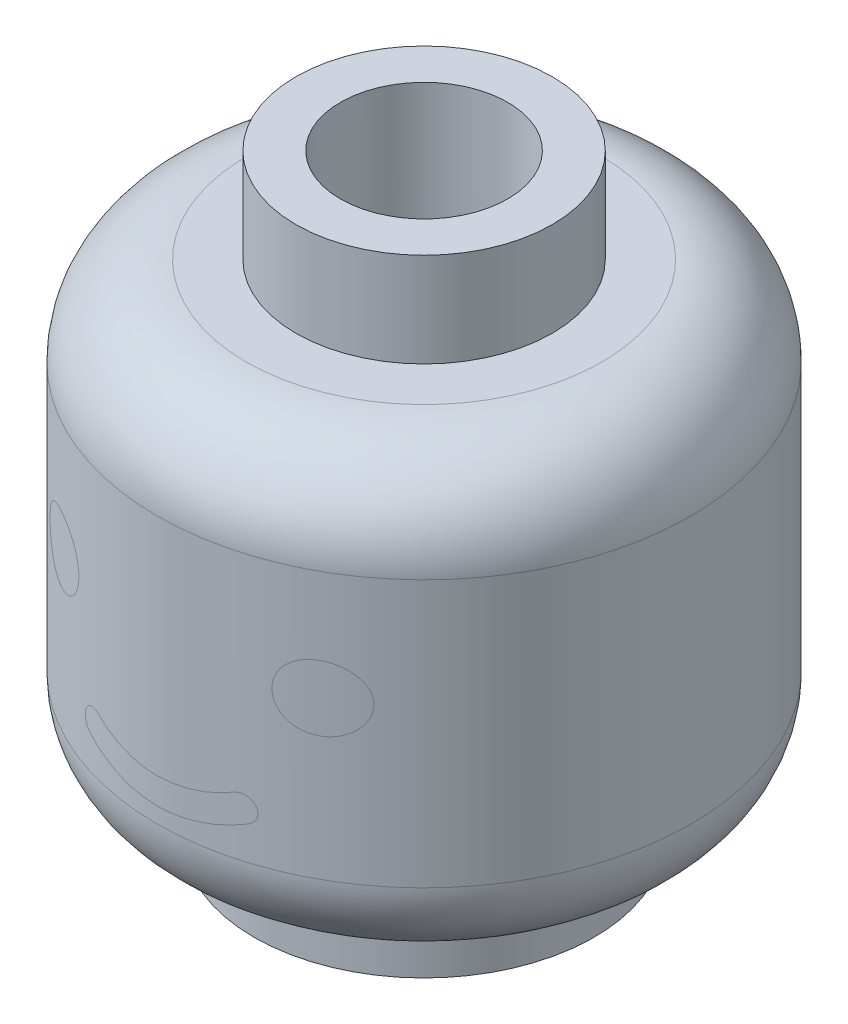
ISO-10303-21;
HEADER;
FILE_DESCRIPTION(('STEP AP214'),'2;1');
FILE_NAME('part.step','',(''),(''),'','','');
FILE_SCHEMA(('AUTOMOTIVE_DESIGN { 1 0 10303 214 1 1 1 1 }'));
ENDSEC;
DATA;
#1=APPLICATION_CONTEXT('core data for automotive mechanical design processes');
#2=APPLICATION_PROTOCOL_DEFINITION('international standard','automotive_design',2000,#1);
#3=PRODUCT_CONTEXT('',#1,'mechanical');
#4=PRODUCT('Part','Part','',(#3));
#5=PRODUCT_RELATED_PRODUCT_CATEGORY('part','',(#4));
#6=PRODUCT_DEFINITION_FORMATION('','',#4);
#7=PRODUCT_DEFINITION_CONTEXT('part definition',#1,'design');
#8=PRODUCT_DEFINITION('design','',#6,#7);
#9=PRODUCT_DEFINITION_SHAPE('','',#8);
#10=(LENGTH_UNIT() NAMED_UNIT(*) SI_UNIT(.MILLI.,.METRE.));
#11=(NAMED_UNIT(*) PLANE_ANGLE_UNIT() SI_UNIT($,.RADIAN.));
#12=(NAMED_UNIT(*) SI_UNIT($,.STERADIAN.) SOLID_ANGLE_UNIT());
#13=UNCERTAINTY_MEASURE_WITH_UNIT(LENGTH_MEASURE(1.E-05),#10,'distance_accuracy_value','');
#14=(GEOMETRIC_REPRESENTATION_CONTEXT(3) GLOBAL_UNCERTAINTY_ASSIGNED_CONTEXT((#13)) GLOBAL_UNIT_ASSIGNED_CONTEXT((#10,
#11,#12)) REPRESENTATION_CONTEXT('',''));
#15=CARTESIAN_POINT('',(0.,0.,0.));
#16=DIRECTION('',(0.,0.,1.));
#17=DIRECTION('',(1.,0.,0.));
#18=AXIS2_PLACEMENT_3D('',#15,#16,#17);
#19=CARTESIAN_POINT('',(0.,16.3137254901961,0.));
#20=DIRECTION('',(0.,1.,0.));
#21=DIRECTION('',(0.,0.,1.));
#22=AXIS2_PLACEMENT_3D('',#19,#20,#21);
#23=CYLINDRICAL_SURFACE('',#22,5.1);
#24=CARTESIAN_POINT('',(-1.50769230769231,3.44138259592501,4.87204925111861));
#25=CARTESIAN_POINT('',(-1.52043967292613,3.4474564505616,4.8681058314694));
#26=CARTESIAN_POINT('',(-1.53269286417562,3.45464139597266,4.8642577897413));
#27=CARTESIAN_POINT('',(-1.55589250859926,3.47104311079215,4.85688619617928));
#28=CARTESIAN_POINT('',(-1.56683698219197,3.48026289965649,4.85336313771352));
#29=CARTESIAN_POINT('',(-1.58707582301318,3.50053973792936,4.84678294474081));
#30=CARTESIAN_POINT('',(-1.59636769813775,3.511599514225,4.84372651487204));
#31=CARTESIAN_POINT('',(-1.61295657674623,3.5352493193438,4.83822771457206));
#32=CARTESIAN_POINT('',(-1.62025545628484,3.54783789283012,4.83578476683059));
#33=CARTESIAN_POINT('',(-1.63236860273475,3.57371605014675,4.83170905341994));
#34=CARTESIAN_POINT('',(-1.63726298223319,3.58696397945491,4.83005024650083));
#35=CARTESIAN_POINT('',(-1.6447606581698,3.6141668867311,4.82750228114942));
#36=CARTESIAN_POINT('',(-1.64736403867611,3.62812183873508,4.82661309447597));
#37=CARTESIAN_POINT('',(-1.65010793974114,3.65565450770353,4.8256756786411));
#38=CARTESIAN_POINT('',(-1.65035529915925,3.66922043101216,4.82559096925891));
#39=CARTESIAN_POINT('',(-1.64865652144264,3.69619560410523,4.82617161631263));
#40=CARTESIAN_POINT('',(-1.64671082263277,3.7096048846566,4.82683682286343));
#41=CARTESIAN_POINT('',(-1.64074370899042,3.73569327241718,4.82886836678685));
#42=CARTESIAN_POINT('',(-1.636752249198,3.74838005856888,4.83022458439052));
#43=CARTESIAN_POINT('',(-1.62685101576418,3.77289142356372,4.83356834226028));
#44=CARTESIAN_POINT('',(-1.62094102115567,3.78471590289853,4.83555595524672));
#45=CARTESIAN_POINT('',(-1.60722465311738,3.80749394622554,4.8401324647687));
#46=CARTESIAN_POINT('',(-1.59937464601847,3.81841842193289,4.84273512540892));
#47=CARTESIAN_POINT('',(-1.58210220160994,3.83880439642772,4.84840541985248));
#48=CARTESIAN_POINT('',(-1.57267943112406,3.84826558441048,4.85147315216454));
#49=CARTESIAN_POINT('',(-1.55204167920406,3.86593665965078,4.85811583063157));
#50=CARTESIAN_POINT('',(-1.54076259669134,3.87406520705755,4.86170800342955));
#51=CARTESIAN_POINT('',(-1.51708078753349,3.88831963859459,4.86914981269255));
#52=CARTESIAN_POINT('',(-1.50467785384334,3.89444515274784,4.87299949656403));
#53=CARTESIAN_POINT('',(-1.47850882396094,3.90478544564119,4.88100468466191));
#54=CARTESIAN_POINT('',(-1.46470682808762,3.90890489353763,4.88516619984672));
#55=CARTESIAN_POINT('',(-1.43659998874011,3.91472073516988,4.89350542540881));
#56=CARTESIAN_POINT('',(-1.42229491773682,3.91641601768843,4.89768314233359));
#57=CARTESIAN_POINT('',(-1.39329369908337,3.91733724973033,4.90601314199094));
#58=CARTESIAN_POINT('',(-1.37859536944953,3.91651433427535,4.91016333509879));
#59=CARTESIAN_POINT('',(-1.34952943734206,3.91228890667593,4.91823099172259));
#60=CARTESIAN_POINT('',(-1.33516133924489,3.90889056122908,4.92214882014501));
#61=CARTESIAN_POINT('',(-1.31133726767923,3.90097933375728,4.92853951469861));
#62=CARTESIAN_POINT('',(-1.30169035471946,3.89709772303175,4.93109580905959));
#63=CARTESIAN_POINT('',(-1.29230769230769,3.89261365365001,4.93355255656635));
#64=B_SPLINE_CURVE_WITH_KNOTS('',3,(#24,#25,#26,#27,#28,#29,#30,#31,#32,#33,#34,#35,#36,#37,#38,
#39,#40,#41,#42,#43,#44,#45,#46,#47,#48,#49,#50,#51,#52,#53,#54,#55,#56,#57,#58,#59,#60,#61,#62,
#63),.UNSPECIFIED.,.F.,.F.,(4,2,2,2,2,2,2,2,2,2,2,2,2,2,2,2,2,2,2,4),(0.,0.0439416944574802,
0.0879490366681005,0.132022189043521,0.176053710146527,0.21849726659161,0.260939265506972,
0.301446942698855,0.341946525088201,0.381869349720329,0.421796774093382,0.462720337939843,
0.503652582116524,0.54653968554057,0.589434706102917,0.634206586345368,0.678998983074021,
0.724666039085703,0.770259369283768,0.802304361634531),.UNSPECIFIED.);
#65=CARTESIAN_POINT('',(-1.50769230769231,3.44138259592501,4.87204925111861));
#66=VERTEX_POINT('',#65);
#67=CARTESIAN_POINT('',(-1.29230769230769,3.89261365365001,4.93355255656635));
#68=VERTEX_POINT('',#67);
#69=EDGE_CURVE('E11',#66,#68,#64,.T.);
#70=ORIENTED_EDGE('',*,*,#69,.F.);
#71=CARTESIAN_POINT('',(1.50769230769231,3.44138259592501,4.87204925111861));
#72=CARTESIAN_POINT('',(1.43370919433084,3.40606022573718,4.89495407410749));
#73=CARTESIAN_POINT('',(1.35811386347073,3.3731766335907,4.91649100065942));
#74=CARTESIAN_POINT('',(1.2040363960122,3.31257851100796,4.95647137250403));
#75=CARTESIAN_POINT('',(1.12555260718713,3.28486699584663,4.97491301264523));
#76=CARTESIAN_POINT('',(0.966045149993206,3.23492201701922,5.00833389598758));
#77=CARTESIAN_POINT('',(0.885019083900302,3.21269391141064,5.02330975175607));
#78=CARTESIAN_POINT('',(0.721007429883761,3.17403383232907,5.04945942252728));
#79=CARTESIAN_POINT('',(0.638022244406141,3.1576006793115,5.06063401124969));
#80=CARTESIAN_POINT('',(0.470341938526446,3.13070423759454,5.0789679987167));
#81=CARTESIAN_POINT('',(0.385641800372108,3.12026231266462,5.08611302716088));
#82=CARTESIAN_POINT('',(0.215422701344379,3.10559103943999,5.09616183980381));
#83=CARTESIAN_POINT('',(0.129903451362181,3.1013639726417,5.09906406645278));
#84=CARTESIAN_POINT('',(-0.0411401584996891,3.09919882840491,5.10054970587997));
#85=CARTESIAN_POINT('',(-0.126664351466689,3.1012521587025,5.09913901919221));
#86=CARTESIAN_POINT('',(-0.297167137913868,3.11159055971056,5.09205163156697));
#87=CARTESIAN_POINT('',(-0.382145530757173,3.11987780304852,5.08637344333132));
#88=CARTESIAN_POINT('',(-0.627524327727558,3.15289499515398,5.06381849287626));
#89=CARTESIAN_POINT('',(-0.786420138809057,3.18572107420379,5.04145572327317));
#90=CARTESIAN_POINT('',(-1.09567577625644,3.27204525157316,4.98339913410561));
#91=CARTESIAN_POINT('',(-1.24604317690775,3.32552466670639,4.94771736399732));
#92=CARTESIAN_POINT('',(-1.43015590623536,3.40523672245375,4.8955445408912));
#93=CARTESIAN_POINT('',(-1.46914933543684,3.42298135034975,4.88398074723492));
#94=CARTESIAN_POINT('',(-1.50769230769231,3.44138259592501,4.87204925111861));
#95=B_SPLINE_CURVE_WITH_KNOTS('',3,(#71,#72,#73,#74,#75,#76,#77,#78,#79,#80,#81,#82,#83,#84,#85,
#86,#87,#88,#89,#90,#91,#92,#93,#94),.UNSPECIFIED.,.F.,.F.,(4,2,2,2,2,2,2,2,2,2,2,4),(0.,
0.255337881999677,0.510824161884533,0.766559107420016,1.02224196881486,1.27883097745243,
1.53551415732444,1.79184632393748,2.04826786819921,2.53727993089787,3.02585066134497,
3.15893086233659),.UNSPECIFIED.);
#96=CARTESIAN_POINT('',(1.50769230769231,3.44138259592501,4.87204925111861));
#97=VERTEX_POINT('',#96);
#98=EDGE_CURVE('E57',#97,#66,#95,.T.);
#99=ORIENTED_EDGE('',*,*,#98,.F.);
#100=CARTESIAN_POINT('',(1.29230769230769,3.89261365365001,4.93355255656635));
#101=CARTESIAN_POINT('',(1.30547581043881,3.89891077888655,4.93010579071236));
#102=CARTESIAN_POINT('',(1.31915183921914,3.90401172049479,4.92646474923008));
#103=CARTESIAN_POINT('',(1.34708624675953,3.9117601564242,4.9188983466482));
#104=CARTESIAN_POINT('',(1.36134377179107,3.91441112127359,4.91497339625197));
#105=CARTESIAN_POINT('',(1.39004433472992,3.9172164010627,4.90693392801757));
#106=CARTESIAN_POINT('',(1.40448733222062,3.91737125099645,4.90281945099037));
#107=CARTESIAN_POINT('',(1.43316537111265,3.9152052568352,4.89451320311304));
#108=CARTESIAN_POINT('',(1.44740038106183,3.91288404215506,4.89032142078514));
#109=CARTESIAN_POINT('',(1.47549454384823,3.90577383065468,4.88191912657831));
#110=CARTESIAN_POINT('',(1.48934426446598,3.90094659642867,4.8777093569631));
#111=CARTESIAN_POINT('',(1.51603731604597,3.88892069454306,4.86947903536574));
#112=CARTESIAN_POINT('',(1.5288805409073,3.88172177728488,4.86545850335008));
#113=CARTESIAN_POINT('',(1.55310868426944,3.86516923307211,4.85777873628787));
#114=CARTESIAN_POINT('',(1.56450118210341,3.85582758520226,4.85411764845266));
#115=CARTESIAN_POINT('',(1.5855404736624,3.8351992503054,4.84728624825094));
#116=CARTESIAN_POINT('',(1.59518767499856,3.82391301863802,4.84411582131643));
#117=CARTESIAN_POINT('',(1.61207593416043,3.80014641023498,4.83852122803878));
#118=CARTESIAN_POINT('',(1.61939231837841,3.78772507738076,4.83607393971924));
#119=CARTESIAN_POINT('',(1.63181270066259,3.76171033048493,4.83189719824589));
#120=CARTESIAN_POINT('',(1.63691744863301,3.74811731560535,4.83016750178512));
#121=CARTESIAN_POINT('',(1.64450910384696,3.7208937992137,4.8275879214484));
#122=CARTESIAN_POINT('',(1.64711633024776,3.70730062387044,4.82669763698213));
#123=CARTESIAN_POINT('',(1.65005099029977,3.67984311327417,4.82569520940822));
#124=CARTESIAN_POINT('',(1.65037895663455,3.66597884213831,4.82558288448446));
#125=CARTESIAN_POINT('',(1.64877055251492,3.6388631223375,4.82613263793194));
#126=CARTESIAN_POINT('',(1.64690908206269,3.62560662147736,4.82676910067593));
#127=CARTESIAN_POINT('',(1.64111461427288,3.59961062361606,4.82874228779956));
#128=CARTESIAN_POINT('',(1.63718173609501,3.58687109692086,4.83007897189828));
#129=CARTESIAN_POINT('',(1.62735714430615,3.5621829071782,4.83339793329887));
#130=CARTESIAN_POINT('',(1.62145500029158,3.55023887047689,4.8353836470812));
#131=CARTESIAN_POINT('',(1.60788974919106,3.52750928414649,4.83991130908473));
#132=CARTESIAN_POINT('',(1.60022584652041,3.51672426115005,4.84245350858198));
#133=CARTESIAN_POINT('',(1.5830338897801,3.49616102461843,4.84810156183211));
#134=CARTESIAN_POINT('',(1.57344402263644,3.48643960952266,4.85122575286047));
#135=CARTESIAN_POINT('',(1.55289999584501,3.46874325292487,4.85784078726189));
#136=CARTESIAN_POINT('',(1.54194736011672,3.4607663876295,4.86133122041112));
#137=CARTESIAN_POINT('',(1.52307834801866,3.44922045026791,4.86726756952062));
#138=CARTESIAN_POINT('',(1.51547539128563,3.44509483345388,4.86964108354754));
#139=CARTESIAN_POINT('',(1.50769230769231,3.44138259592501,4.87204925111861));
#140=B_SPLINE_CURVE_WITH_KNOTS('',3,(#100,#101,#102,#103,#104,#105,#106,#107,#108,#109,#110,
#111,#112,#113,#114,#115,#116,#117,#118,#119,#120,#121,#122,#123,#124,#125,#126,#127,#128,#129,
#130,#131,#132,#133,#134,#135,#136,#137,#138,#139),.UNSPECIFIED.,.F.,.F.,(4,2,2,2,2,2,2,2,2,2,2,
2,2,2,2,2,2,2,2,4),(0.,0.0449214831244463,0.0897792344966953,0.134627371348439,0.17948222142776,
0.225042517255218,0.270607609431845,0.315923921130961,0.361229635578572,0.404872239555664,
0.448500033938545,0.489901006361839,0.531292302680101,0.571307829525006,0.611321054689822,
0.651549670089936,0.691796487962447,0.733637428926002,0.775431994718162,0.802293138858678),.UNSPECIFIED.);
#141=CARTESIAN_POINT('',(1.29230769230769,3.89261365365001,4.93355255656635));
#142=VERTEX_POINT('',#141);
#143=EDGE_CURVE('E367',#142,#97,#140,.T.);
#144=ORIENTED_EDGE('',*,*,#143,.F.);
#145=CARTESIAN_POINT('',(-1.29230769230769,3.89261365365001,4.93355255656635));
#146=CARTESIAN_POINT('',(-1.22588861700081,3.86090324758803,4.95095914365787));
#147=CARTESIAN_POINT('',(-1.15805426576759,3.83153246813223,4.96728590296533));
#148=CARTESIAN_POINT('',(-1.01989445783117,3.77771272134513,4.99747898840957));
#149=CARTESIAN_POINT('',(-0.94956784997922,3.75326606419884,5.01134415931557));
#150=CARTESIAN_POINT('',(-0.80694697347522,3.70960436625362,5.03627524479221));
#151=CARTESIAN_POINT('',(-0.734656246731728,3.69038051719443,5.04734587009734));
#152=CARTESIAN_POINT('',(-0.588491034726498,3.65733093315705,5.06647048512419));
#153=CARTESIAN_POINT('',(-0.514616830545435,3.64350424837156,5.07452500561787));
#154=CARTESIAN_POINT('',(-0.290786918112005,3.61032081744428,5.09390065599043));
#155=CARTESIAN_POINT('',(-0.139033730680465,3.59938691469713,5.10036060400772));
#156=CARTESIAN_POINT('',(0.164334920099962,3.6006664313833,5.09960801603805));
#157=CARTESIAN_POINT('',(0.315950389038476,3.61287886513585,5.09239606226549));
#158=CARTESIAN_POINT('',(0.537331849244905,3.64760150206827,5.07213847664396));
#159=CARTESIAN_POINT('',(0.609022976641742,3.66156465448469,5.064012679066));
#160=CARTESIAN_POINT('',(0.750868622750049,3.69457576168832,5.04492865198251));
#161=CARTESIAN_POINT('',(0.821022933784497,3.71362439916953,5.03397004219623));
#162=CARTESIAN_POINT('',(0.959438057657607,3.75663226680731,5.0094336969898));
#163=CARTESIAN_POINT('',(1.02769609882791,3.7805982955604,4.99585233700146));
#164=CARTESIAN_POINT('',(1.16184995911023,3.83317864627253,4.96637071044));
#165=CARTESIAN_POINT('',(1.22774673756994,3.8617910537253,4.95047139923637));
#166=CARTESIAN_POINT('',(1.29230769230769,3.89261365365001,4.93355255656635));
#167=B_SPLINE_CURVE_WITH_KNOTS('',3,(#145,#146,#147,#148,#149,#150,#151,#152,#153,#154,#155,
#156,#157,#158,#159,#160,#161,#162,#163,#164,#165,#166),.UNSPECIFIED.,.F.,.F.,(4,2,2,2,2,2,2,2,
2,2,4),(0.,0.226855024268325,0.453816232457578,0.680392260630389,0.90692839735625,
1.36128855000063,1.81562935426994,2.035892168566,2.2561845666244,2.4767836099487,
2.697291986622),.UNSPECIFIED.);
#168=EDGE_CURVE('E361',#68,#142,#167,.T.);
#169=ORIENTED_EDGE('',*,*,#168,.F.);
#170=EDGE_LOOP('',(#70,#99,#144,#169));
#171=FACE_BOUND('',#170,.T.);
#172=ADVANCED_FACE('F42',(#171),#23,.T.);
#173=CARTESIAN_POINT('',(3.095,5.8,4.0535139077102));
#174=CARTESIAN_POINT('',(3.09499860193585,5.76973944700259,4.05351520990944));
#175=CARTESIAN_POINT('',(3.09278766178486,5.73946755154224,4.05520602983803));
#176=CARTESIAN_POINT('',(3.08409267226761,5.67990287616726,4.0618223283753));
#177=CARTESIAN_POINT('',(3.07760525295517,5.65061088758105,4.06675035795551));
#178=CARTESIAN_POINT('',(3.06080334550029,5.59397829701904,4.07941069466848));
#179=CARTESIAN_POINT('',(3.05050880681332,5.56662839350486,4.08712837921838));
#180=CARTESIAN_POINT('',(3.02659584988562,5.51424445416662,4.10486765296008));
#181=CARTESIAN_POINT('',(3.01297657074637,5.48921102048146,4.11488983883357));
#182=CARTESIAN_POINT('',(2.98163294767719,5.43974161690707,4.13766486035557));
#183=CARTESIAN_POINT('',(2.96365703173191,5.41554014135022,4.15057798734039));
#184=CARTESIAN_POINT('',(2.92495832811053,5.37043965001354,4.17793983665437));
#185=CARTESIAN_POINT('',(2.9042342616573,5.34954218164892,4.19238927323921));
#186=CARTESIAN_POINT('',(2.85620082544248,5.30736765028644,4.22529532660076));
#187=CARTESIAN_POINT('',(2.8283988144999,5.28682871744111,4.24398018116912));
#188=CARTESIAN_POINT('',(2.77022658703615,5.25076242413528,4.28217918969877));
#189=CARTESIAN_POINT('',(2.739854509567,5.23523873500976,4.30169393940038));
#190=CARTESIAN_POINT('',(2.67243169046927,5.20740590893491,4.34395165708201));
#191=CARTESIAN_POINT('',(2.63506267930364,5.19592874977712,4.3667396050707));
#192=CARTESIAN_POINT('',(2.55862354696581,5.18008460849631,4.41196322532));
#193=CARTESIAN_POINT('',(2.51955276207472,5.17572042650937,4.43439875540534));
#194=CARTESIAN_POINT('',(2.4392707814489,5.17442051245818,4.47907820666036));
#195=CARTESIAN_POINT('',(2.3980335025884,5.17776162207383,4.50128527055906));
#196=CARTESIAN_POINT('',(2.31616559816084,5.19280193941225,4.54395252845122));
#197=CARTESIAN_POINT('',(2.27553473276848,5.20449774850702,4.564413428983));
#198=CARTESIAN_POINT('',(2.19940954765823,5.23522952074063,4.60154988307877));
#199=CARTESIAN_POINT('',(2.16375676573106,5.25366751074028,4.61839271449915));
#200=CARTESIAN_POINT('',(2.09592297204455,5.29768366935435,4.6495697657722));
#201=CARTESIAN_POINT('',(2.06373906836366,5.32325582554589,4.66390608154946));
#202=CARTESIAN_POINT('',(2.00782280643256,5.37766871267084,4.68822715267566));
#203=CARTESIAN_POINT('',(1.98354629633834,5.40581292125308,4.6985206527866));
#204=CARTESIAN_POINT('',(1.94010086196038,5.4665010857607,4.71662634450064));
#205=CARTESIAN_POINT('',(1.9209288069266,5.49904232627361,4.72444005761565));
#206=CARTESIAN_POINT('',(1.89009195435159,5.56437844594724,4.73685599133932));
#207=CARTESIAN_POINT('',(1.87790556056775,5.59688504466468,4.74168450559473));
#208=CARTESIAN_POINT('',(1.85905654473972,5.66370395844926,4.74910651657552));
#209=CARTESIAN_POINT('',(1.85239206114323,5.69801566082599,4.75170076653013));
#210=CARTESIAN_POINT('',(1.84506116193845,5.76567479081071,4.75455189833201));
#211=CARTESIAN_POINT('',(1.84411930354593,5.79898818188775,4.75491612322934));
#212=CARTESIAN_POINT('',(1.8475348885831,5.86529824031593,4.75359003329659));
#213=CARTESIAN_POINT('',(1.8518916575595,5.89829494743844,4.75189997995212));
#214=CARTESIAN_POINT('',(1.86564259871342,5.96262201623424,4.74651773484516));
#215=CARTESIAN_POINT('',(1.87497451161927,5.99396782192859,4.74285028209161));
#216=CARTESIAN_POINT('',(1.89827394433829,6.0545751910436,4.73357288763884));
#217=CARTESIAN_POINT('',(1.9122416015323,6.08383669266445,4.7279628883718));
#218=CARTESIAN_POINT('',(1.94459925360048,6.14007567413724,4.7147474575013));
#219=CARTESIAN_POINT('',(1.96306837257127,6.16699907019828,4.70710607285697));
#220=CARTESIAN_POINT('',(2.00360948770874,6.21731210056007,4.68999277485842));
#221=CARTESIAN_POINT('',(2.02568209851579,6.24070113069828,4.68052054917055));
#222=CARTESIAN_POINT('',(2.07388815582137,6.28459905511428,4.65936838278014));
#223=CARTESIAN_POINT('',(2.10017090727434,6.30490134929583,4.64760075102104));
#224=CARTESIAN_POINT('',(2.15503335901651,6.34083035809273,4.62241740714542));
#225=CARTESIAN_POINT('',(2.18361376667129,6.35645562577322,4.60900118681087));
#226=CARTESIAN_POINT('',(2.24467717791531,6.38400957409357,4.57959207992872));
#227=CARTESIAN_POINT('',(2.27728747840728,6.3955258483194,4.56347787002957));
#228=CARTESIAN_POINT('',(2.3433079341888,6.41297765223635,4.52993172346121));
#229=CARTESIAN_POINT('',(2.37671842702197,6.41891078271666,4.51249922376442));
#230=CARTESIAN_POINT('',(2.44701857025755,6.42567551206257,4.47480161963922));
#231=CARTESIAN_POINT('',(2.48390866670006,6.42591234520609,4.45443047845522));
#232=CARTESIAN_POINT('',(2.55678538677833,6.42002533739243,4.41300452057061));
#233=CARTESIAN_POINT('',(2.59277162760133,6.41389884637722,4.39194942256952));
#234=CARTESIAN_POINT('',(2.6662715936861,6.39470463785228,4.34775754752757));
#235=CARTESIAN_POINT('',(2.70362575043334,6.38105534439383,4.32460589287634));
#236=CARTESIAN_POINT('',(2.77542179929066,6.34674239519464,4.27888397771699));
#237=CARTESIAN_POINT('',(2.80986077083904,6.32607180672019,4.25631431564991));
#238=CARTESIAN_POINT('',(2.87521235954335,6.27760461201537,4.21244850739157));
#239=CARTESIAN_POINT('',(2.90607217390348,6.24971716700727,4.19117321133667));
#240=CARTESIAN_POINT('',(2.96238699485579,6.18721987408048,4.15155937417582));
#241=CARTESIAN_POINT('',(2.98785473518364,6.15262624224585,4.13321393978616));
#242=CARTESIAN_POINT('',(3.02464224828533,6.08959469501384,4.10632208099494));
#243=CARTESIAN_POINT('',(3.03787229533079,6.06279497201175,4.0965267546273));
#244=CARTESIAN_POINT('',(3.0605420992893,6.006860330539,4.0796179282492));
#245=CARTESIAN_POINT('',(3.06998826793891,5.97772946354869,4.07249989286133));
#246=CARTESIAN_POINT('',(3.08309706894776,5.9238696484317,4.06258118535075));
#247=CARTESIAN_POINT('',(3.08754141143147,5.89943598512386,4.05919967300131));
#248=CARTESIAN_POINT('',(3.09349349891351,5.85000414099652,4.05466546251341));
#249=CARTESIAN_POINT('',(3.09500115529656,5.82500594316506,4.05351283163204));
#250=CARTESIAN_POINT('',(3.095,5.8,4.0535139077102));
#251=B_SPLINE_CURVE_WITH_KNOTS('',3,(#173,#174,#175,#176,#177,#178,#179,#180,#181,#182,#183,
#184,#185,#186,#187,#188,#189,#190,#191,#192,#193,#194,#195,#196,#197,#198,#199,#200,#201,#202,
#203,#204,#205,#206,#207,#208,#209,#210,#211,#212,#213,#214,#215,#216,#217,#218,#219,#220,#221,
#222,#223,#224,#225,#226,#227,#228,#229,#230,#231,#232,#233,#234,#235,#236,#237,#238,#239,#240,
#241,#242,#243,#244,#245,#246,#247,#248,#249,#250),.UNSPECIFIED.,.T.,.F.,(4,2,2,2,2,2,2,2,2,2,2,
2,2,2,2,2,2,2,2,2,2,2,2,2,2,2,2,2,2,2,2,2,2,2,2,2,2,2,4),(0.,0.0906787627947074,
0.181429067721731,0.271710424098317,0.362015182506259,0.460048594000146,0.558127783807477,
0.675552291108697,0.793062563530542,0.928207018511045,1.0634046624073,1.20353508450097,
1.34360853504654,1.47345948899792,1.60320133803532,1.7182731462541,1.83327421325887,
1.9378900710966,2.04247064635766,2.14197490073356,2.241466490707,2.33974129513164,
2.43801901220197,2.53816759256269,2.63833327294725,2.74358604597446,2.84887134754808,
2.96286094284713,3.07689949987094,3.20279867331579,3.32875029952491,3.4661777460219,
3.60374128291714,3.74312854094349,3.88218286175426,3.97617380616964,4.0700048034043,
4.14493534315316,4.21986814391581),.UNSPECIFIED.);
#252=CARTESIAN_POINT('',(3.095,5.8,4.0535139077102));
#253=VERTEX_POINT('',#252);
#254=EDGE_CURVE('E249',#253,#253,#251,.T.);
#255=ORIENTED_EDGE('',*,*,#254,.F.);
#256=EDGE_LOOP('',(#255));
#257=FACE_BOUND('',#256,.T.);
#258=ADVANCED_FACE('F328',(#257),#23,.T.);
#259=CARTESIAN_POINT('',(-1.845,5.8,4.75457411341962));
#260=CARTESIAN_POINT('',(-1.84499920350535,5.76677691435292,4.75457430406465));
#261=CARTESIAN_POINT('',(-1.84765745197126,5.7335591049611,4.7535454255577));
#262=CARTESIAN_POINT('',(-1.85817944941604,5.66809411240501,4.74944215005716));
#263=CARTESIAN_POINT('',(-1.86604227741473,5.63584675856837,4.74636811496525));
#264=CARTESIAN_POINT('',(-1.88664902018034,5.57325933553667,4.7382145341163));
#265=CARTESIAN_POINT('',(-1.89938834187857,5.54291750278007,4.7331368753926));
#266=CARTESIAN_POINT('',(-1.92925604716883,5.48490358633524,4.72104115046017));
#267=CARTESIAN_POINT('',(-1.94638479583096,5.45723172497305,4.71402292284985));
#268=CARTESIAN_POINT('',(-1.98480643471912,5.40465898064081,4.69797663281727));
#269=CARTESIAN_POINT('',(-2.00617959699848,5.37982892466047,4.68890927025737));
#270=CARTESIAN_POINT('',(-2.05209341399138,5.33413635977726,4.66899755599778));
#271=CARTESIAN_POINT('',(-2.07663468338846,5.3132746227649,4.65815285934522));
#272=CARTESIAN_POINT('',(-2.12971385871981,5.27466832798192,4.63413613951042));
#273=CARTESIAN_POINT('',(-2.15840568668008,5.2572000639758,4.62086102409777));
#274=CARTESIAN_POINT('',(-2.21757981665435,5.22727869080855,4.59275666253795));
#275=CARTESIAN_POINT('',(-2.24806277153514,5.21482742350292,4.57792684813813));
#276=CARTESIAN_POINT('',(-2.31285861824305,5.19403514917957,4.54555965109184));
#277=CARTESIAN_POINT('',(-2.34726529958598,5.18617966834549,4.5278986997305));
#278=CARTESIAN_POINT('',(-2.4163055058728,5.17633387089331,4.49143570938817));
#279=CARTESIAN_POINT('',(-2.45093911465559,5.17434586059947,4.47263322466797));
#280=CARTESIAN_POINT('',(-2.52325916921179,5.17611685537798,4.43227373534371));
#281=CARTESIAN_POINT('',(-2.56088490612101,5.18050036852163,4.41063463996238));
#282=CARTESIAN_POINT('',(-2.63457975318231,5.19588293893036,4.36701578478511));
#283=CARTESIAN_POINT('',(-2.67064760647881,5.20688723461655,4.34503576867941));
#284=CARTESIAN_POINT('',(-2.74295186748084,5.23630198019467,4.29978635465344));
#285=CARTESIAN_POINT('',(-2.77900785672802,5.25519502552169,4.27654015828697));
#286=CARTESIAN_POINT('',(-2.84733166068423,5.30008583986028,4.23135638780459));
#287=CARTESIAN_POINT('',(-2.87960210218252,5.3260786401692,4.20941791152427));
#288=CARTESIAN_POINT('',(-2.93268717134774,5.37854822916121,4.17254799257693));
#289=CARTESIAN_POINT('',(-2.95446987197282,5.40370412439204,4.15712735978474));
#290=CARTESIAN_POINT('',(-2.99421695880275,5.45802025889412,4.12859077400189));
#291=CARTESIAN_POINT('',(-3.01218660388554,5.48717489056293,4.11547165120855));
#292=CARTESIAN_POINT('',(-3.0409034903585,5.54399980300233,4.09428532299961));
#293=CARTESIAN_POINT('',(-3.05235046496813,5.57113791146193,4.08574326423624));
#294=CARTESIAN_POINT('',(-3.07143318348613,5.6274193458188,4.07141762829973));
#295=CARTESIAN_POINT('',(-3.07907113905306,5.65656149688173,4.06563245046557));
#296=CARTESIAN_POINT('',(-3.09010947772414,5.71624909526878,4.05724946012816));
#297=CARTESIAN_POINT('',(-3.09348879207714,5.74680075044504,4.05466749583518));
#298=CARTESIAN_POINT('',(-3.09569963467274,5.8081628768688,4.05297992234742));
#299=CARTESIAN_POINT('',(-3.09453227476647,5.8389732830022,4.05387346324686));
#300=CARTESIAN_POINT('',(-3.08802567175795,5.89724716137949,4.05883124428674));
#301=CARTESIAN_POINT('',(-3.08304283395885,5.92477532018316,4.06262456648456));
#302=CARTESIAN_POINT('',(-3.06961591270729,5.97847171493769,4.07277894827268));
#303=CARTESIAN_POINT('',(-3.06117119267949,6.00463969978032,4.07914048010538));
#304=CARTESIAN_POINT('',(-3.04069350634257,6.05641611063272,4.09442957878904));
#305=CARTESIAN_POINT('',(-3.02849675209748,6.08192464060328,4.10347340152777));
#306=CARTESIAN_POINT('',(-3.00119582895742,6.13050501229469,4.12348274141375));
#307=CARTESIAN_POINT('',(-2.98609033819963,6.15357573875547,4.13444913206001));
#308=CARTESIAN_POINT('',(-2.95070954185588,6.20068570870961,4.15979090755149));
#309=CARTESIAN_POINT('',(-2.92999230215708,6.22425034360192,4.17443000782861));
#310=CARTESIAN_POINT('',(-2.88582877191806,6.26762265631486,4.20508222358603));
#311=CARTESIAN_POINT('',(-2.86238068216117,6.28742783436931,4.22109624308335));
#312=CARTESIAN_POINT('',(-2.80858923836408,6.32658207113989,4.25711881931157));
#313=CARTESIAN_POINT('',(-2.77778215172349,6.34512992997841,4.2773083445416));
#314=CARTESIAN_POINT('',(-2.71374426873498,6.37661808503823,4.31822174831926));
#315=CARTESIAN_POINT('',(-2.68051192130769,6.38955475524054,4.33894596325404));
#316=CARTESIAN_POINT('',(-2.60813242880629,6.41084755140794,4.38288088828667));
#317=CARTESIAN_POINT('',(-2.56875826416209,6.41845245861287,4.40608654373895));
#318=CARTESIAN_POINT('',(-2.48882428826254,6.42600499085684,4.45172688427581));
#319=CARTESIAN_POINT('',(-2.44826422911635,6.42595100332806,4.47416140600486));
#320=CARTESIAN_POINT('',(-2.36715265082265,6.41782512050633,4.51759928211651));
#321=CARTESIAN_POINT('',(-2.32660113155463,6.40975334717147,4.53860265826299));
#322=CARTESIAN_POINT('',(-2.24698327012814,6.38533644602389,4.57854194541311));
#323=CARTESIAN_POINT('',(-2.20791601521389,6.36899649429261,4.59747914089103));
#324=CARTESIAN_POINT('',(-2.13649451888951,6.32999794486318,4.63106954949723));
#325=CARTESIAN_POINT('',(-2.10385383669216,6.30806791178041,4.64595735309994));
#326=CARTESIAN_POINT('',(-2.04268538693218,6.25780992856741,4.67317417679004));
#327=CARTESIAN_POINT('',(-2.01415420983071,6.22948733283777,4.6855053218409));
#328=CARTESIAN_POINT('',(-1.96552275174193,6.1706997814256,4.70609624318402));
#329=CARTESIAN_POINT('',(-1.94483793675522,6.14082254564893,4.71465616030132));
#330=CARTESIAN_POINT('',(-1.90878827661837,6.0774751149707,4.72936655302359));
#331=CARTESIAN_POINT('',(-1.89342141667525,6.04400628711169,4.73551794125487));
#332=CARTESIAN_POINT('',(-1.86923845718362,5.97596079838044,4.74511446619856));
#333=CARTESIAN_POINT('',(-1.86018381238167,5.94148278662441,4.74865846920509));
#334=CARTESIAN_POINT('',(-1.84806584661198,5.8713342663301,4.75338786164922));
#335=CARTESIAN_POINT('',(-1.84500085501568,5.83566409313245,4.75457390876729));
#336=CARTESIAN_POINT('',(-1.845,5.8,4.75457411341962));
#337=B_SPLINE_CURVE_WITH_KNOTS('',3,(#259,#260,#261,#262,#263,#264,#265,#266,#267,#268,#269,
#270,#271,#272,#273,#274,#275,#276,#277,#278,#279,#280,#281,#282,#283,#284,#285,#286,#287,#288,
#289,#290,#291,#292,#293,#294,#295,#296,#297,#298,#299,#300,#301,#302,#303,#304,#305,#306,#307,
#308,#309,#310,#311,#312,#313,#314,#315,#316,#317,#318,#319,#320,#321,#322,#323,#324,#325,#326,
#327,#328,#329,#330,#331,#332,#333,#334,#335,#336),.UNSPECIFIED.,.T.,.F.,(4,2,2,2,2,2,2,2,2,2,2,
2,2,2,2,2,2,2,2,2,2,2,2,2,2,2,2,2,2,2,2,2,2,2,2,2,2,2,4),(0.,0.0995396134183573,
0.199061617438708,0.298490113473083,0.397926881693869,0.499462764286355,0.601018376800005,
0.708920840821429,0.816862882318314,0.934769207151073,1.05272187120697,1.18304336994216,
1.3134681160352,1.45342709615701,1.59328837704528,1.70289628355717,1.81235202446057,
1.9039731398253,1.9955409944317,2.08756010614522,2.17955671676834,2.26387342363708,
2.34820564172932,2.43692418242666,2.52568313644157,2.62917137321433,2.73272818294955,
2.85595521069489,2.97926175104852,3.11760918654601,3.25598575091373,3.39436021047522,
3.53264815122218,3.65808113191996,3.78340943749031,3.89481210487365,4.00617251923513,
4.11305544572557,4.21990855627139),.UNSPECIFIED.);
#338=CARTESIAN_POINT('',(-1.845,5.8,4.75457411341962));
#339=VERTEX_POINT('',#338);
#340=EDGE_CURVE('E241',#339,#339,#337,.T.);
#341=ORIENTED_EDGE('',*,*,#340,.F.);
#342=EDGE_LOOP('',(#341));
#343=FACE_BOUND('',#342,.T.);
#344=ADVANCED_FACE('F266',(#343),#23,.T.);
#345=CARTESIAN_POINT('',(0.,9.4,0.));
#346=DIRECTION('',(0.,-1.,0.));
#347=DIRECTION('',(0.,0.,-1.));
#348=AXIS2_PLACEMENT_3D('',#345,#346,#347);
#349=PLANE('',#348);
#350=DIRECTION('',(0.866025403784436,0.,0.500000000000004));
#351=VECTOR('',#350,1.);
#352=CARTESIAN_POINT('',(1.54704898937922,9.4,0.408214924348354));
#353=LINE('',#352,#351);
#354=CARTESIAN_POINT('',(0.420000000000002,9.4,-0.242487113059641));
#355=VERTEX_POINT('',#354);
#356=CARTESIAN_POINT('',(1.54704898937922,9.4,0.408214924348354));
#357=VERTEX_POINT('',#356);
#358=EDGE_CURVE('E130',#355,#357,#353,.T.);
#359=ORIENTED_EDGE('',*,*,#358,.F.);
#360=DIRECTION('',(0.,0.,1.));
#361=VECTOR('',#360,1.);
#362=CARTESIAN_POINT('',(0.420000000000002,9.4,-0.242487113059641));
#363=LINE('',#362,#361);
#364=CARTESIAN_POINT('',(0.42000000000001,9.4,-1.54389118787562));
#365=VERTEX_POINT('',#364);
#366=EDGE_CURVE('E139',#365,#355,#363,.T.);
#367=ORIENTED_EDGE('',*,*,#366,.F.);
#368=CARTESIAN_POINT('',(0.,9.4,0.));
#369=DIRECTION('',(0.,1.,0.));
#370=DIRECTION('',(0.,0.,1.));
#371=AXIS2_PLACEMENT_3D('',#368,#369,#370);
#372=CIRCLE('',#371,1.6);
#373=CARTESIAN_POINT('',(-0.42,9.4,-1.54389118787562));
#374=VERTEX_POINT('',#373);
#375=EDGE_CURVE('E222',#365,#374,#372,.T.);
#376=ORIENTED_EDGE('',*,*,#375,.T.);
#377=DIRECTION('',(0.,0.,-1.));
#378=VECTOR('',#377,1.);
#379=CARTESIAN_POINT('',(-0.42,9.4,-1.54389118787562));
#380=LINE('',#379,#378);
#381=CARTESIAN_POINT('',(-0.42,9.4,-0.242487113059643));
#382=VERTEX_POINT('',#381);
#383=EDGE_CURVE('E178',#382,#374,#380,.T.);
#384=ORIENTED_EDGE('',*,*,#383,.F.);
#385=DIRECTION('',(0.86602540378444,0.,-0.499999999999998));
#386=VECTOR('',#385,1.);
#387=CARTESIAN_POINT('',(-0.42,9.4,-0.242487113059643));
#388=LINE('',#387,#386);
#389=CARTESIAN_POINT('',(-1.54704898937922,9.4,0.408214924348344));
#390=VERTEX_POINT('',#389);
#391=EDGE_CURVE('E176',#390,#382,#388,.T.);
#392=ORIENTED_EDGE('',*,*,#391,.F.);
#393=CARTESIAN_POINT('',(-1.12704898937923,9.4,1.13567626352727));
#394=VERTEX_POINT('',#393);
#395=EDGE_CURVE('E223',#390,#394,#372,.T.);
#396=ORIENTED_EDGE('',*,*,#395,.T.);
#397=DIRECTION('',(-0.866025403784443,0.,0.499999999999992));
#398=VECTOR('',#397,1.);
#399=CARTESIAN_POINT('',(-1.12704898937923,9.4,1.13567626352727));
#400=LINE('',#399,#398);
#401=CARTESIAN_POINT('',(0.,9.4,0.484974226119286));
#402=VERTEX_POINT('',#401);
#403=EDGE_CURVE('E160',#402,#394,#400,.T.);
#404=ORIENTED_EDGE('',*,*,#403,.F.);
#405=DIRECTION('',(-0.866025403784433,0.,-0.50000000000001));
#406=VECTOR('',#405,1.);
#407=CARTESIAN_POINT('',(0.,9.4,0.484974226119286));
#408=LINE('',#407,#406);
#409=CARTESIAN_POINT('',(1.12704898937921,9.4,1.13567626352729));
#410=VERTEX_POINT('',#409);
#411=EDGE_CURVE('E157',#410,#402,#408,.T.);
#412=ORIENTED_EDGE('',*,*,#411,.F.);
#413=EDGE_CURVE('E151',#410,#357,#372,.T.);
#414=ORIENTED_EDGE('',*,*,#413,.T.);
#415=EDGE_LOOP('',(#359,#367,#376,#384,#392,#396,#404,#412,#414));
#416=FACE_BOUND('',#415,.T.);
#417=ADVANCED_FACE('F148',(#416),#349,.F.);
#418=CARTESIAN_POINT('',(0.,8.5,-2.45));
#419=DIRECTION('',(0.,1.,0.));
#420=DIRECTION('',(0.,0.,1.));
#421=AXIS2_PLACEMENT_3D('',#418,#419,#420);
#422=PLANE('',#421);
#423=CARTESIAN_POINT('',(0.,8.5,0.));
#424=DIRECTION('',(0.,1.,0.));
#425=DIRECTION('',(0.,0.,1.));
#426=AXIS2_PLACEMENT_3D('',#423,#424,#425);
#427=CIRCLE('',#426,1.6);
#428=CARTESIAN_POINT('',(1.54704898937922,8.5,0.408214924348354));
#429=VERTEX_POINT('',#428);
#430=CARTESIAN_POINT('',(0.42000000000001,8.5,-1.54389118787562));
#431=VERTEX_POINT('',#430);
#432=EDGE_CURVE('E238',#429,#431,#427,.T.);
#433=ORIENTED_EDGE('',*,*,#432,.T.);
#434=DIRECTION('',(0.,0.,1.));
#435=VECTOR('',#434,1.);
#436=CARTESIAN_POINT('',(0.420000000000017,8.5,-2.45));
#437=LINE('',#436,#435);
#438=CARTESIAN_POINT('',(0.420000000000002,8.5,-0.242487113059641));
#439=VERTEX_POINT('',#438);
#440=EDGE_CURVE('E174',#431,#439,#437,.T.);
#441=ORIENTED_EDGE('',*,*,#440,.T.);
#442=DIRECTION('',(0.866025403784436,0.,0.500000000000004));
#443=VECTOR('',#442,1.);
#444=CARTESIAN_POINT('',(-0.850881119635942,8.5,-0.976230669589473));
#445=LINE('',#444,#443);
#446=EDGE_CURVE('E133',#439,#429,#445,.T.);
#447=ORIENTED_EDGE('',*,*,#446,.T.);
#448=EDGE_LOOP('',(#433,#441,#447));
#449=FACE_BOUND('',#448,.T.);
#450=CARTESIAN_POINT('',(0.,8.5,0.));
#451=DIRECTION('',(0.,1.,0.));
#452=DIRECTION('',(0.,0.,1.));
#453=AXIS2_PLACEMENT_3D('',#450,#451,#452);
#454=CIRCLE('',#453,1.6);
#455=CARTESIAN_POINT('',(-1.12704898937923,8.5,1.13567626352727));
#456=VERTEX_POINT('',#455);
#457=CARTESIAN_POINT('',(1.12704898937921,8.5,1.13567626352729));
#458=VERTEX_POINT('',#457);
#459=EDGE_CURVE('E235',#456,#458,#454,.T.);
#460=ORIENTED_EDGE('',*,*,#459,.T.);
#461=DIRECTION('',(-0.866025403784433,0.,-0.50000000000001));
#462=VECTOR('',#461,1.);
#463=CARTESIAN_POINT('',(-1.27088111963596,8.5,-0.248769330410562));
#464=LINE('',#463,#462);
#465=CARTESIAN_POINT('',(0.,8.5,0.484974226119286));
#466=VERTEX_POINT('',#465);
#467=EDGE_CURVE('E170',#458,#466,#464,.T.);
#468=ORIENTED_EDGE('',*,*,#467,.T.);
#469=DIRECTION('',(-0.866025403784443,0.,0.499999999999992));
#470=VECTOR('',#469,1.);
#471=CARTESIAN_POINT('',(1.27088111963592,8.5,-0.248769330410514));
#472=LINE('',#471,#470);
#473=EDGE_CURVE('E155',#466,#456,#472,.T.);
#474=ORIENTED_EDGE('',*,*,#473,.T.);
#475=EDGE_LOOP('',(#460,#468,#474));
#476=FACE_BOUND('',#475,.T.);
#477=CARTESIAN_POINT('',(0.,8.5,0.));
#478=DIRECTION('',(0.,1.,0.));
#479=DIRECTION('',(0.,0.,1.));
#480=AXIS2_PLACEMENT_3D('',#477,#478,#479);
#481=CIRCLE('',#480,1.6);
#482=CARTESIAN_POINT('',(-0.42,8.5,-1.54389118787562));
#483=VERTEX_POINT('',#482);
#484=CARTESIAN_POINT('',(-1.54704898937922,8.5,0.408214924348344));
#485=VERTEX_POINT('',#484);
#486=EDGE_CURVE('E229',#483,#485,#481,.T.);
#487=ORIENTED_EDGE('',*,*,#486,.T.);
#488=DIRECTION('',(0.86602540378444,0.,-0.499999999999998));
#489=VECTOR('',#488,1.);
#490=CARTESIAN_POINT('',(0.850881119635936,8.5,-0.976230669589461));
#491=LINE('',#490,#489);
#492=CARTESIAN_POINT('',(-0.42,8.5,-0.242487113059643));
#493=VERTEX_POINT('',#492);
#494=EDGE_CURVE('E232',#485,#493,#491,.T.);
#495=ORIENTED_EDGE('',*,*,#494,.T.);
#496=DIRECTION('',(0.,0.,-1.));
#497=VECTOR('',#496,1.);
#498=CARTESIAN_POINT('',(-0.42,8.5,-2.45));
#499=LINE('',#498,#497);
#500=EDGE_CURVE('E226',#493,#483,#499,.T.);
#501=ORIENTED_EDGE('',*,*,#500,.T.);
#502=EDGE_LOOP('',(#487,#495,#501));
#503=FACE_BOUND('',#502,.T.);
#504=CARTESIAN_POINT('',(0.,8.5,0.));
#505=DIRECTION('',(0.,1.,0.));
#506=DIRECTION('',(0.,0.,1.));
#507=AXIS2_PLACEMENT_3D('',#504,#505,#506);
#508=CIRCLE('',#507,2.45);
#509=CARTESIAN_POINT('',(0.,8.5,2.45));
#510=VERTEX_POINT('',#509);
#511=EDGE_CURVE('E184',#510,#510,#508,.T.);
#512=ORIENTED_EDGE('',*,*,#511,.F.);
#513=EDGE_LOOP('',(#512));
#514=FACE_BOUND('',#513,.T.);
#515=ADVANCED_FACE('F259',(#449,#476,#503,#514),#422,.F.);
#516=CARTESIAN_POINT('',(0.,16.3137254901961,0.));
#517=DIRECTION('',(0.,1.,0.));
#518=DIRECTION('',(0.,0.,1.));
#519=AXIS2_PLACEMENT_3D('',#516,#517,#518);
#520=CYLINDRICAL_SURFACE('',#519,1.6);
#521=ORIENTED_EDGE('',*,*,#395,.F.);
#522=DIRECTION('',(0.,1.,0.));
#523=VECTOR('',#522,1.);
#524=CARTESIAN_POINT('',(-1.54704898937922,-0.600000000000002,0.408214924348344));
#525=LINE('',#524,#523);
#526=EDGE_CURVE('E182',#485,#390,#525,.T.);
#527=ORIENTED_EDGE('',*,*,#526,.F.);
#528=ORIENTED_EDGE('',*,*,#486,.F.);
#529=DIRECTION('',(0.,1.,0.));
#530=VECTOR('',#529,1.);
#531=CARTESIAN_POINT('',(-0.42,-0.600000000000002,-1.54389118787562));
#532=LINE('',#531,#530);
#533=EDGE_CURVE('E185',#483,#374,#532,.T.);
#534=ORIENTED_EDGE('',*,*,#533,.T.);
#535=ORIENTED_EDGE('',*,*,#375,.F.);
#536=DIRECTION('',(0.,1.,0.));
#537=VECTOR('',#536,1.);
#538=CARTESIAN_POINT('',(0.42000000000001,-0.600000000000002,-1.54389118787562));
#539=LINE('',#538,#537);
#540=EDGE_CURVE('E142',#431,#365,#539,.T.);
#541=ORIENTED_EDGE('',*,*,#540,.F.);
#542=ORIENTED_EDGE('',*,*,#432,.F.);
#543=DIRECTION('',(0.,1.,0.));
#544=VECTOR('',#543,1.);
#545=CARTESIAN_POINT('',(1.54704898937922,-0.600000000000002,0.408214924348354));
#546=LINE('',#545,#544);
#547=EDGE_CURVE('E136',#429,#357,#546,.T.);
#548=ORIENTED_EDGE('',*,*,#547,.T.);
#549=ORIENTED_EDGE('',*,*,#413,.F.);
#550=DIRECTION('',(0.,1.,0.));
#551=VECTOR('',#550,1.);
#552=CARTESIAN_POINT('',(1.12704898937921,-0.600000000000002,1.13567626352729));
#553=LINE('',#552,#551);
#554=EDGE_CURVE('E145',#458,#410,#553,.T.);
#555=ORIENTED_EDGE('',*,*,#554,.F.);
#556=ORIENTED_EDGE('',*,*,#459,.F.);
#557=DIRECTION('',(0.,1.,0.));
#558=VECTOR('',#557,1.);
#559=CARTESIAN_POINT('',(-1.12704898937923,-0.600000000000002,1.13567626352727));
#560=LINE('',#559,#558);
#561=EDGE_CURVE('E164',#456,#394,#560,.T.);
#562=ORIENTED_EDGE('',*,*,#561,.T.);
#563=EDGE_LOOP('',(#521,#527,#528,#534,#535,#541,#542,#548,#549,#555,#556,#562));
#564=FACE_BOUND('',#563,.T.);
#565=CARTESIAN_POINT('',(0.,11.4,0.));
#566=DIRECTION('',(0.,1.,0.));
#567=DIRECTION('',(0.,0.,1.));
#568=AXIS2_PLACEMENT_3D('',#565,#566,#567);
#569=CIRCLE('',#568,1.6);
#570=CARTESIAN_POINT('',(0.,11.4,1.6));
#571=VERTEX_POINT('',#570);
#572=EDGE_CURVE('E219',#571,#571,#569,.T.);
#573=ORIENTED_EDGE('',*,*,#572,.T.);
#574=EDGE_LOOP('',(#573));
#575=FACE_BOUND('',#574,.T.);
#576=ADVANCED_FACE('F262',(#564,#575),#520,.F.);
#577=CARTESIAN_POINT('',(0.,11.4,-1.6));
#578=DIRECTION('',(0.,-1.,0.));
#579=DIRECTION('',(0.,0.,-1.));
#580=AXIS2_PLACEMENT_3D('',#577,#578,#579);
#581=PLANE('',#580);
#582=ORIENTED_EDGE('',*,*,#572,.F.);
#583=EDGE_LOOP('',(#582));
#584=FACE_BOUND('',#583,.T.);
#585=CARTESIAN_POINT('',(0.,11.4,0.));
#586=DIRECTION('',(0.,1.,0.));
#587=DIRECTION('',(0.,0.,1.));
#588=AXIS2_PLACEMENT_3D('',#585,#586,#587);
#589=CIRCLE('',#588,2.45);
#590=CARTESIAN_POINT('',(0.,11.4,2.45));
#591=VERTEX_POINT('',#590);
#592=EDGE_CURVE('E216',#591,#591,#589,.T.);
#593=ORIENTED_EDGE('',*,*,#592,.T.);
#594=EDGE_LOOP('',(#593));
#595=FACE_BOUND('',#594,.T.);
#596=ADVANCED_FACE('F269',(#584,#595),#581,.F.);
#597=CARTESIAN_POINT('',(0.,16.3137254901961,0.));
#598=DIRECTION('',(0.,1.,0.));
#599=DIRECTION('',(0.,0.,1.));
#600=AXIS2_PLACEMENT_3D('',#597,#598,#599);
#601=CYLINDRICAL_SURFACE('',#600,2.45);
#602=ORIENTED_EDGE('',*,*,#592,.F.);
#603=EDGE_LOOP('',(#602));
#604=FACE_BOUND('',#603,.T.);
#605=CARTESIAN_POINT('',(0.,9.6,0.));
#606=DIRECTION('',(0.,1.,0.));
#607=DIRECTION('',(0.,0.,1.));
#608=AXIS2_PLACEMENT_3D('',#605,#606,#607);
#609=CIRCLE('',#608,2.45);
#610=CARTESIAN_POINT('',(0.,9.6,2.45));
#611=VERTEX_POINT('',#610);
#612=EDGE_CURVE('E213',#611,#611,#609,.T.);
#613=ORIENTED_EDGE('',*,*,#612,.T.);
#614=EDGE_LOOP('',(#613));
#615=FACE_BOUND('',#614,.T.);
#616=ADVANCED_FACE('F273',(#604,#615),#601,.T.);
#617=CARTESIAN_POINT('',(0.,9.6,-2.45));
#618=DIRECTION('',(0.,-1.,0.));
#619=DIRECTION('',(0.,0.,-1.));
#620=AXIS2_PLACEMENT_3D('',#617,#618,#619);
#621=PLANE('',#620);
#622=ORIENTED_EDGE('',*,*,#612,.F.);
#623=EDGE_LOOP('',(#622));
#624=FACE_BOUND('',#623,.T.);
#625=CARTESIAN_POINT('',(0.,9.6,0.));
#626=DIRECTION('',(0.,1.,0.));
#627=DIRECTION('',(0.,0.,1.));
#628=AXIS2_PLACEMENT_3D('',#625,#626,#627);
#629=CIRCLE('',#628,3.39999999999999);
#630=CARTESIAN_POINT('',(0.,9.6,3.39999999999999));
#631=VERTEX_POINT('',#630);
#632=EDGE_CURVE('E210',#631,#631,#629,.T.);
#633=ORIENTED_EDGE('',*,*,#632,.T.);
#634=EDGE_LOOP('',(#633));
#635=FACE_BOUND('',#634,.T.);
#636=ADVANCED_FACE('F277',(#624,#635),#621,.F.);
#637=CARTESIAN_POINT('',(0.,7.9,0.));
#638=DIRECTION('',(0.,1.,0.));
#639=DIRECTION('',(0.,0.,1.));
#640=AXIS2_PLACEMENT_3D('',#637,#638,#639);
#641=TOROIDAL_SURFACE('',#640,3.4,1.7);
#642=ORIENTED_EDGE('',*,*,#632,.F.);
#643=EDGE_LOOP('',(#642));
#644=FACE_BOUND('',#643,.T.);
#645=CARTESIAN_POINT('',(0.,7.89999999999999,0.));
#646=DIRECTION('',(0.,1.,0.));
#647=DIRECTION('',(0.,0.,1.));
#648=AXIS2_PLACEMENT_3D('',#645,#646,#647);
#649=CIRCLE('',#648,5.1);
#650=CARTESIAN_POINT('',(0.,7.89999999999999,5.1));
#651=VERTEX_POINT('',#650);
#652=EDGE_CURVE('E207',#651,#651,#649,.T.);
#653=ORIENTED_EDGE('',*,*,#652,.T.);
#654=EDGE_LOOP('',(#653));
#655=FACE_BOUND('',#654,.T.);
#656=ADVANCED_FACE('F281',(#644,#655),#641,.T.);
#657=ORIENTED_EDGE('',*,*,#98,.T.);
#658=ORIENTED_EDGE('',*,*,#69,.T.);
#659=ORIENTED_EDGE('',*,*,#168,.T.);
#660=ORIENTED_EDGE('',*,*,#143,.T.);
#661=EDGE_LOOP('',(#657,#658,#659,#660));
#662=FACE_BOUND('',#661,.T.);
#663=ORIENTED_EDGE('',*,*,#254,.T.);
#664=EDGE_LOOP('',(#663));
#665=FACE_BOUND('',#664,.T.);
#666=ORIENTED_EDGE('',*,*,#340,.T.);
#667=EDGE_LOOP('',(#666));
#668=FACE_BOUND('',#667,.T.);
#669=ORIENTED_EDGE('',*,*,#652,.F.);
#670=EDGE_LOOP('',(#669));
#671=FACE_BOUND('',#670,.T.);
#672=CARTESIAN_POINT('',(0.,2.80000000000001,0.));
#673=DIRECTION('',(0.,1.,0.));
#674=DIRECTION('',(0.,0.,1.));
#675=AXIS2_PLACEMENT_3D('',#672,#673,#674);
#676=CIRCLE('',#675,5.1);
#677=CARTESIAN_POINT('',(0.,2.80000000000001,5.1));
#678=VERTEX_POINT('',#677);
#679=EDGE_CURVE('E204',#678,#678,#676,.T.);
#680=ORIENTED_EDGE('',*,*,#679,.T.);
#681=EDGE_LOOP('',(#680));
#682=FACE_BOUND('',#681,.T.);
#683=ADVANCED_FACE('F255',(#662,#665,#668,#671,#682),#23,.T.);
#684=CARTESIAN_POINT('',(0.,2.8,0.));
#685=DIRECTION('',(0.,1.,0.));
#686=DIRECTION('',(0.,0.,1.));
#687=AXIS2_PLACEMENT_3D('',#684,#685,#686);
#688=TOROIDAL_SURFACE('',#687,3.4,1.7);
#689=ORIENTED_EDGE('',*,*,#679,.F.);
#690=EDGE_LOOP('',(#689));
#691=FACE_BOUND('',#690,.T.);
#692=CARTESIAN_POINT('',(0.,1.1,0.));
#693=DIRECTION('',(0.,1.,0.));
#694=DIRECTION('',(0.,0.,1.));
#695=AXIS2_PLACEMENT_3D('',#692,#693,#694);
#696=CIRCLE('',#695,3.39999999999999);
#697=CARTESIAN_POINT('',(0.,1.1,3.39999999999999));
#698=VERTEX_POINT('',#697);
#699=EDGE_CURVE('E201',#698,#698,#696,.T.);
#700=ORIENTED_EDGE('',*,*,#699,.T.);
#701=EDGE_LOOP('',(#700));
#702=FACE_BOUND('',#701,.T.);
#703=ADVANCED_FACE('F286',(#691,#702),#688,.T.);
#704=CARTESIAN_POINT('',(0.,1.1,-3.39999999999999));
#705=DIRECTION('',(0.,1.,0.));
#706=DIRECTION('',(0.,0.,1.));
#707=AXIS2_PLACEMENT_3D('',#704,#705,#706);
#708=PLANE('',#707);
#709=ORIENTED_EDGE('',*,*,#699,.F.);
#710=EDGE_LOOP('',(#709));
#711=FACE_BOUND('',#710,.T.);
#712=CARTESIAN_POINT('',(0.,1.1,0.));
#713=DIRECTION('',(0.,1.,0.));
#714=DIRECTION('',(0.,0.,1.));
#715=AXIS2_PLACEMENT_3D('',#712,#713,#714);
#716=CIRCLE('',#715,3.25);
#717=CARTESIAN_POINT('',(0.,1.1,3.25));
#718=VERTEX_POINT('',#717);
#719=EDGE_CURVE('E198',#718,#718,#716,.T.);
#720=ORIENTED_EDGE('',*,*,#719,.T.);
#721=EDGE_LOOP('',(#720));
#722=FACE_BOUND('',#721,.T.);
#723=ADVANCED_FACE('F289',(#711,#722),#708,.F.);
#724=CARTESIAN_POINT('',(0.,16.3137254901961,0.));
#725=DIRECTION('',(0.,1.,0.));
#726=DIRECTION('',(0.,0.,1.));
#727=AXIS2_PLACEMENT_3D('',#724,#725,#726);
#728=CYLINDRICAL_SURFACE('',#727,3.25);
#729=ORIENTED_EDGE('',*,*,#719,.F.);
#730=EDGE_LOOP('',(#729));
#731=FACE_BOUND('',#730,.T.);
#732=CARTESIAN_POINT('',(0.,0.,0.));
#733=DIRECTION('',(0.,1.,0.));
#734=DIRECTION('',(0.,0.,1.));
#735=AXIS2_PLACEMENT_3D('',#732,#733,#734);
#736=CIRCLE('',#735,3.25);
#737=CARTESIAN_POINT('',(0.,0.,3.25));
#738=VERTEX_POINT('',#737);
#739=EDGE_CURVE('E195',#738,#738,#736,.T.);
#740=ORIENTED_EDGE('',*,*,#739,.T.);
#741=EDGE_LOOP('',(#740));
#742=FACE_BOUND('',#741,.T.);
#743=ADVANCED_FACE('F293',(#731,#742),#728,.T.);
#744=CARTESIAN_POINT('',(0.,0.,-3.25));
#745=DIRECTION('',(0.,1.,0.));
#746=DIRECTION('',(0.,0.,1.));
#747=AXIS2_PLACEMENT_3D('',#744,#745,#746);
#748=PLANE('',#747);
#749=ORIENTED_EDGE('',*,*,#739,.F.);
#750=EDGE_LOOP('',(#749));
#751=FACE_BOUND('',#750,.T.);
#752=CARTESIAN_POINT('',(0.,0.,0.));
#753=DIRECTION('',(0.,1.,0.));
#754=DIRECTION('',(0.,0.,1.));
#755=AXIS2_PLACEMENT_3D('',#752,#753,#754);
#756=CIRCLE('',#755,2.45);
#757=CARTESIAN_POINT('',(0.,0.,2.45));
#758=VERTEX_POINT('',#757);
#759=EDGE_CURVE('E192',#758,#758,#756,.T.);
#760=ORIENTED_EDGE('',*,*,#759,.T.);
#761=EDGE_LOOP('',(#760));
#762=FACE_BOUND('',#761,.T.);
#763=ADVANCED_FACE('F297',(#751,#762),#748,.F.);
#764=CARTESIAN_POINT('',(0.,16.3137254901961,0.));
#765=DIRECTION('',(0.,1.,0.));
#766=DIRECTION('',(0.,0.,1.));
#767=AXIS2_PLACEMENT_3D('',#764,#765,#766);
#768=CYLINDRICAL_SURFACE('',#767,2.45);
#769=ORIENTED_EDGE('',*,*,#759,.F.);
#770=EDGE_LOOP('',(#769));
#771=FACE_BOUND('',#770,.T.);
#772=ORIENTED_EDGE('',*,*,#511,.T.);
#773=EDGE_LOOP('',(#772));
#774=FACE_BOUND('',#773,.T.);
#775=ADVANCED_FACE('F301',(#771,#774),#768,.F.);
#776=CARTESIAN_POINT('',(-0.42,-0.600000000000002,-0.242487113059643));
#777=DIRECTION('',(0.499999999999998,0.,0.86602540378444));
#778=DIRECTION('',(0.86602540378444,0.,-0.499999999999998));
#779=AXIS2_PLACEMENT_3D('',#776,#777,#778);
#780=PLANE('',#779);
#781=ORIENTED_EDGE('',*,*,#526,.T.);
#782=ORIENTED_EDGE('',*,*,#391,.T.);
#783=DIRECTION('',(0.,1.,0.));
#784=VECTOR('',#783,1.);
#785=CARTESIAN_POINT('',(-0.42,-0.600000000000002,-0.242487113059643));
#786=LINE('',#785,#784);
#787=EDGE_CURVE('E181',#493,#382,#786,.T.);
#788=ORIENTED_EDGE('',*,*,#787,.F.);
#789=ORIENTED_EDGE('',*,*,#494,.F.);
#790=EDGE_LOOP('',(#781,#782,#788,#789));
#791=FACE_BOUND('',#790,.T.);
#792=ADVANCED_FACE('F305',(#791),#780,.F.);
#793=CARTESIAN_POINT('',(-0.42,-0.600000000000002,-1.54389118787562));
#794=DIRECTION('',(1.,0.,0.));
#795=DIRECTION('',(0.,0.,-1.));
#796=AXIS2_PLACEMENT_3D('',#793,#794,#795);
#797=PLANE('',#796);
#798=ORIENTED_EDGE('',*,*,#787,.T.);
#799=ORIENTED_EDGE('',*,*,#383,.T.);
#800=ORIENTED_EDGE('',*,*,#533,.F.);
#801=ORIENTED_EDGE('',*,*,#500,.F.);
#802=EDGE_LOOP('',(#798,#799,#800,#801));
#803=FACE_BOUND('',#802,.T.);
#804=ADVANCED_FACE('F309',(#803),#797,.F.);
#805=CARTESIAN_POINT('',(0.,-0.600000000000002,0.484974226119286));
#806=DIRECTION('',(0.50000000000001,0.,-0.866025403784433));
#807=DIRECTION('',(-0.866025403784433,0.,-0.50000000000001));
#808=AXIS2_PLACEMENT_3D('',#805,#806,#807);
#809=PLANE('',#808);
#810=ORIENTED_EDGE('',*,*,#554,.T.);
#811=ORIENTED_EDGE('',*,*,#411,.T.);
#812=DIRECTION('',(0.,1.,0.));
#813=VECTOR('',#812,1.);
#814=CARTESIAN_POINT('',(0.,-0.600000000000002,0.484974226119286));
#815=LINE('',#814,#813);
#816=EDGE_CURVE('E162',#466,#402,#815,.T.);
#817=ORIENTED_EDGE('',*,*,#816,.F.);
#818=ORIENTED_EDGE('',*,*,#467,.F.);
#819=EDGE_LOOP('',(#810,#811,#817,#818));
#820=FACE_BOUND('',#819,.T.);
#821=ADVANCED_FACE('F313',(#820),#809,.F.);
#822=CARTESIAN_POINT('',(-1.12704898937923,-0.600000000000002,1.13567626352727));
#823=DIRECTION('',(-0.499999999999992,0.,-0.866025403784443));
#824=DIRECTION('',(-0.866025403784443,0.,0.499999999999992));
#825=AXIS2_PLACEMENT_3D('',#822,#823,#824);
#826=PLANE('',#825);
#827=ORIENTED_EDGE('',*,*,#816,.T.);
#828=ORIENTED_EDGE('',*,*,#403,.T.);
#829=ORIENTED_EDGE('',*,*,#561,.F.);
#830=ORIENTED_EDGE('',*,*,#473,.F.);
#831=EDGE_LOOP('',(#827,#828,#829,#830));
#832=FACE_BOUND('',#831,.T.);
#833=ADVANCED_FACE('F317',(#832),#826,.F.);
#834=CARTESIAN_POINT('',(0.420000000000002,-0.600000000000002,-0.242487113059641));
#835=DIRECTION('',(-1.,0.,0.));
#836=DIRECTION('',(0.,0.,1.));
#837=AXIS2_PLACEMENT_3D('',#834,#835,#836);
#838=PLANE('',#837);
#839=ORIENTED_EDGE('',*,*,#540,.T.);
#840=ORIENTED_EDGE('',*,*,#366,.T.);
#841=DIRECTION('',(0.,1.,0.));
#842=VECTOR('',#841,1.);
#843=CARTESIAN_POINT('',(0.420000000000002,-0.600000000000002,-0.242487113059641));
#844=LINE('',#843,#842);
#845=EDGE_CURVE('E126',#439,#355,#844,.T.);
#846=ORIENTED_EDGE('',*,*,#845,.F.);
#847=ORIENTED_EDGE('',*,*,#440,.F.);
#848=EDGE_LOOP('',(#839,#840,#846,#847));
#849=FACE_BOUND('',#848,.T.);
#850=ADVANCED_FACE('F140',(#849),#838,.F.);
#851=CARTESIAN_POINT('',(1.54704898937922,-0.600000000000002,0.408214924348354));
#852=DIRECTION('',(-0.500000000000004,0.,0.866025403784436));
#853=DIRECTION('',(0.866025403784436,0.,0.500000000000004));
#854=AXIS2_PLACEMENT_3D('',#851,#852,#853);
#855=PLANE('',#854);
#856=ORIENTED_EDGE('',*,*,#845,.T.);
#857=ORIENTED_EDGE('',*,*,#358,.T.);
#858=ORIENTED_EDGE('',*,*,#547,.F.);
#859=ORIENTED_EDGE('',*,*,#446,.F.);
#860=EDGE_LOOP('',(#856,#857,#858,#859));
#861=FACE_BOUND('',#860,.T.);
#862=ADVANCED_FACE('F128',(#861),#855,.F.);
#863=CLOSED_SHELL('',(#172,#258,#344,#417,#515,#576,#596,#616,#636,#656,#683,#703,#723,#743,
#763,#775,#792,#804,#821,#833,#850,#862));
#864=MANIFOLD_SOLID_BREP('B2',#863);
#865=ADVANCED_BREP_SHAPE_REPRESENTATION('',(#18,#864),#14);
#866=SHAPE_DEFINITION_REPRESENTATION(#9,#865);
ENDSEC;
END-ISO-10303-21;
